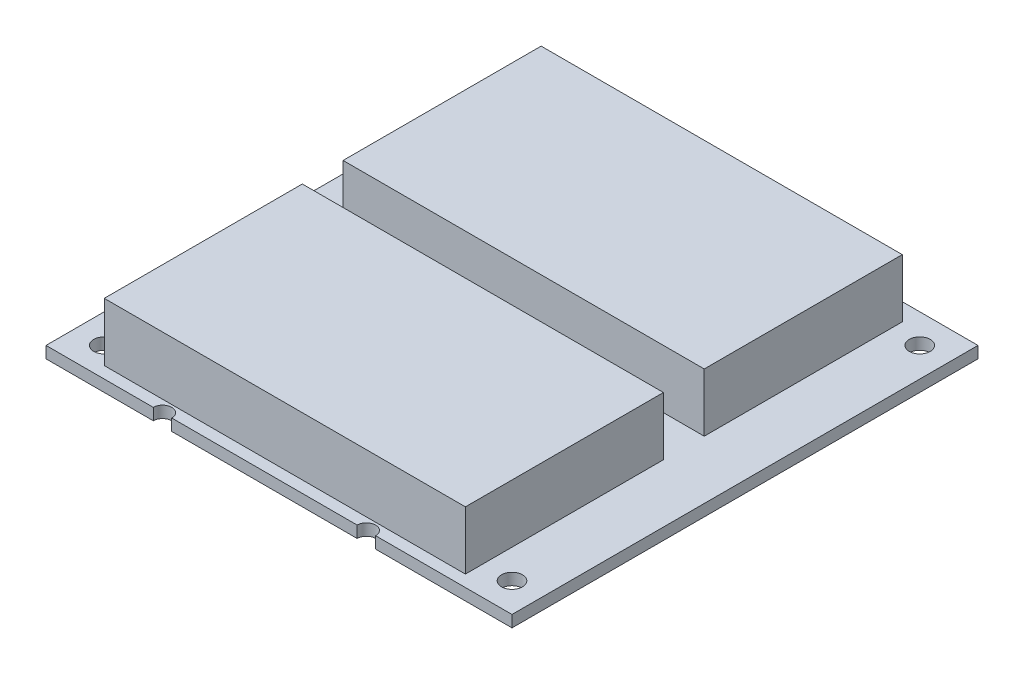
ISO-10303-21;
HEADER;
FILE_DESCRIPTION(('STEP AP214'),'2;1');
FILE_NAME('part.step','',(''),(''),'','','');
FILE_SCHEMA(('AUTOMOTIVE_DESIGN { 1 0 10303 214 1 1 1 1 }'));
ENDSEC;
DATA;
#1=APPLICATION_CONTEXT('core data for automotive mechanical design processes');
#2=APPLICATION_PROTOCOL_DEFINITION('international standard','automotive_design',2000,#1);
#3=PRODUCT_CONTEXT('',#1,'mechanical');
#4=PRODUCT('Part','Part','',(#3));
#5=PRODUCT_RELATED_PRODUCT_CATEGORY('part','',(#4));
#6=PRODUCT_DEFINITION_FORMATION('','',#4);
#7=PRODUCT_DEFINITION_CONTEXT('part definition',#1,'design');
#8=PRODUCT_DEFINITION('design','',#6,#7);
#9=PRODUCT_DEFINITION_SHAPE('','',#8);
#10=(LENGTH_UNIT() NAMED_UNIT(*) SI_UNIT(.MILLI.,.METRE.));
#11=(NAMED_UNIT(*) PLANE_ANGLE_UNIT() SI_UNIT($,.RADIAN.));
#12=(NAMED_UNIT(*) SI_UNIT($,.STERADIAN.) SOLID_ANGLE_UNIT());
#13=UNCERTAINTY_MEASURE_WITH_UNIT(LENGTH_MEASURE(1.E-05),#10,'distance_accuracy_value','');
#14=(GEOMETRIC_REPRESENTATION_CONTEXT(3) GLOBAL_UNCERTAINTY_ASSIGNED_CONTEXT((#13)) GLOBAL_UNIT_ASSIGNED_CONTEXT((#10,
#11,#12)) REPRESENTATION_CONTEXT('',''));
#15=CARTESIAN_POINT('',(0.,0.,0.));
#16=DIRECTION('',(0.,0.,1.));
#17=DIRECTION('',(1.,0.,0.));
#18=AXIS2_PLACEMENT_3D('',#15,#16,#17);
#19=CARTESIAN_POINT('',(0.,2.,-80.));
#20=DIRECTION('',(0.,0.,1.));
#21=DIRECTION('',(1.,0.,0.));
#22=AXIS2_PLACEMENT_3D('',#19,#20,#21);
#23=PLANE('',#22);
#24=DIRECTION('',(-1.,0.,0.));
#25=VECTOR('',#24,1.);
#26=CARTESIAN_POINT('',(0.,0.,-80.));
#27=LINE('',#26,#25);
#28=CARTESIAN_POINT('',(80.,0.,-80.));
#29=VERTEX_POINT('',#28);
#30=CARTESIAN_POINT('',(56.5875,0.,-80.));
#31=VERTEX_POINT('',#30);
#32=EDGE_CURVE('E187',#29,#31,#27,.T.);
#33=ORIENTED_EDGE('',*,*,#32,.T.);
#34=DIRECTION('',(0.,1.,0.));
#35=VECTOR('',#34,1.);
#36=CARTESIAN_POINT('',(56.5875,0.,-80.));
#37=LINE('',#36,#35);
#38=CARTESIAN_POINT('',(56.5875,2.,-80.));
#39=VERTEX_POINT('',#38);
#40=EDGE_CURVE('E47',#31,#39,#37,.T.);
#41=ORIENTED_EDGE('',*,*,#40,.T.);
#42=DIRECTION('',(-1.,0.,0.));
#43=VECTOR('',#42,1.);
#44=CARTESIAN_POINT('',(0.,2.,-80.));
#45=LINE('',#44,#43);
#46=CARTESIAN_POINT('',(80.,2.,-80.));
#47=VERTEX_POINT('',#46);
#48=EDGE_CURVE('E199',#47,#39,#45,.T.);
#49=ORIENTED_EDGE('',*,*,#48,.F.);
#50=DIRECTION('',(0.,-1.,0.));
#51=VECTOR('',#50,1.);
#52=CARTESIAN_POINT('',(80.,2.,-80.));
#53=LINE('',#52,#51);
#54=EDGE_CURVE('E198',#47,#29,#53,.T.);
#55=ORIENTED_EDGE('',*,*,#54,.T.);
#56=EDGE_LOOP('',(#33,#41,#49,#55));
#57=FACE_BOUND('',#56,.T.);
#58=ADVANCED_FACE('F33',(#57),#23,.F.);
#59=CARTESIAN_POINT('',(0.,2.,0.));
#60=DIRECTION('',(0.,0.,-1.));
#61=DIRECTION('',(-1.,0.,0.));
#62=AXIS2_PLACEMENT_3D('',#59,#60,#61);
#63=PLANE('',#62);
#64=DIRECTION('',(1.,0.,0.));
#65=VECTOR('',#64,1.);
#66=CARTESIAN_POINT('',(0.,0.,0.));
#67=LINE('',#66,#65);
#68=CARTESIAN_POINT('',(21.5875,0.,0.));
#69=VERTEX_POINT('',#68);
#70=CARTESIAN_POINT('',(53.4125,0.,0.));
#71=VERTEX_POINT('',#70);
#72=EDGE_CURVE('E232',#69,#71,#67,.T.);
#73=ORIENTED_EDGE('',*,*,#72,.T.);
#74=DIRECTION('',(0.,1.,0.));
#75=VECTOR('',#74,1.);
#76=CARTESIAN_POINT('',(53.4125,0.,0.));
#77=LINE('',#76,#75);
#78=CARTESIAN_POINT('',(53.4125,2.,0.));
#79=VERTEX_POINT('',#78);
#80=EDGE_CURVE('E55',#71,#79,#77,.T.);
#81=ORIENTED_EDGE('',*,*,#80,.T.);
#82=DIRECTION('',(1.,0.,0.));
#83=VECTOR('',#82,1.);
#84=CARTESIAN_POINT('',(0.,2.,0.));
#85=LINE('',#84,#83);
#86=CARTESIAN_POINT('',(21.5875,2.,0.));
#87=VERTEX_POINT('',#86);
#88=EDGE_CURVE('E370',#87,#79,#85,.T.);
#89=ORIENTED_EDGE('',*,*,#88,.F.);
#90=DIRECTION('',(0.,1.,0.));
#91=VECTOR('',#90,1.);
#92=CARTESIAN_POINT('',(21.5875,0.,0.));
#93=LINE('',#92,#91);
#94=EDGE_CURVE('E247',#87,#69,#93,.F.);
#95=ORIENTED_EDGE('',*,*,#94,.T.);
#96=EDGE_LOOP('',(#73,#81,#89,#95));
#97=FACE_BOUND('',#96,.T.);
#98=ADVANCED_FACE('F244',(#97),#63,.F.);
#99=CARTESIAN_POINT('',(53.4125,2.,-80.));
#100=VERTEX_POINT('',#99);
#101=CARTESIAN_POINT('',(21.5875,2.,-80.));
#102=VERTEX_POINT('',#101);
#103=EDGE_CURVE('E180',#100,#102,#45,.T.);
#104=ORIENTED_EDGE('',*,*,#103,.F.);
#105=DIRECTION('',(0.,1.,0.));
#106=VECTOR('',#105,1.);
#107=CARTESIAN_POINT('',(53.4125,0.,-80.));
#108=LINE('',#107,#106);
#109=CARTESIAN_POINT('',(53.4125,0.,-80.));
#110=VERTEX_POINT('',#109);
#111=EDGE_CURVE('E168',#100,#110,#108,.F.);
#112=ORIENTED_EDGE('',*,*,#111,.T.);
#113=CARTESIAN_POINT('',(21.5875,0.,-80.));
#114=VERTEX_POINT('',#113);
#115=EDGE_CURVE('E178',#110,#114,#27,.T.);
#116=ORIENTED_EDGE('',*,*,#115,.T.);
#117=DIRECTION('',(0.,1.,0.));
#118=VECTOR('',#117,1.);
#119=CARTESIAN_POINT('',(21.5875,0.,-80.));
#120=LINE('',#119,#118);
#121=EDGE_CURVE('E213',#114,#102,#120,.T.);
#122=ORIENTED_EDGE('',*,*,#121,.T.);
#123=EDGE_LOOP('',(#104,#112,#116,#122));
#124=FACE_BOUND('',#123,.T.);
#125=ADVANCED_FACE('F176',(#124),#23,.F.);
#126=CARTESIAN_POINT('',(0.,0.,0.));
#127=VERTEX_POINT('',#126);
#128=CARTESIAN_POINT('',(18.4125,0.,0.));
#129=VERTEX_POINT('',#128);
#130=EDGE_CURVE('E226',#127,#129,#67,.T.);
#131=ORIENTED_EDGE('',*,*,#130,.T.);
#132=DIRECTION('',(0.,1.,0.));
#133=VECTOR('',#132,1.);
#134=CARTESIAN_POINT('',(18.4125,0.,0.));
#135=LINE('',#134,#133);
#136=CARTESIAN_POINT('',(18.4125,2.,0.));
#137=VERTEX_POINT('',#136);
#138=EDGE_CURVE('E276',#129,#137,#135,.T.);
#139=ORIENTED_EDGE('',*,*,#138,.T.);
#140=CARTESIAN_POINT('',(0.,2.,0.));
#141=VERTEX_POINT('',#140);
#142=EDGE_CURVE('E367',#141,#137,#85,.T.);
#143=ORIENTED_EDGE('',*,*,#142,.F.);
#144=DIRECTION('',(0.,-1.,0.));
#145=VECTOR('',#144,1.);
#146=CARTESIAN_POINT('',(0.,2.,0.));
#147=LINE('',#146,#145);
#148=EDGE_CURVE('E205',#141,#127,#147,.T.);
#149=ORIENTED_EDGE('',*,*,#148,.T.);
#150=EDGE_LOOP('',(#131,#139,#143,#149));
#151=FACE_BOUND('',#150,.T.);
#152=ADVANCED_FACE('F395',(#151),#63,.F.);
#153=CARTESIAN_POINT('',(0.,2.,0.));
#154=DIRECTION('',(0.,-1.,0.));
#155=DIRECTION('',(0.,0.,-1.));
#156=AXIS2_PLACEMENT_3D('',#153,#154,#155);
#157=PLANE('',#156);
#158=CARTESIAN_POINT('',(55.,2.,-40.));
#159=DIRECTION('',(0.,1.,0.));
#160=DIRECTION('',(0.,0.,1.));
#161=AXIS2_PLACEMENT_3D('',#158,#159,#160);
#162=CIRCLE('',#161,1.5875);
#163=CARTESIAN_POINT('',(55.,2.,-38.4125));
#164=VERTEX_POINT('',#163);
#165=EDGE_CURVE('E260',#164,#164,#162,.T.);
#166=ORIENTED_EDGE('',*,*,#165,.F.);
#167=EDGE_LOOP('',(#166));
#168=FACE_BOUND('',#167,.T.);
#169=CARTESIAN_POINT('',(20.,2.,-40.));
#170=DIRECTION('',(0.,1.,0.));
#171=DIRECTION('',(0.,0.,1.));
#172=AXIS2_PLACEMENT_3D('',#169,#170,#171);
#173=CIRCLE('',#172,1.5875);
#174=CARTESIAN_POINT('',(20.,2.,-38.4125));
#175=VERTEX_POINT('',#174);
#176=EDGE_CURVE('E266',#175,#175,#173,.T.);
#177=ORIENTED_EDGE('',*,*,#176,.F.);
#178=EDGE_LOOP('',(#177));
#179=FACE_BOUND('',#178,.T.);
#180=CARTESIAN_POINT('',(5.,2.,-5.));
#181=DIRECTION('',(0.,1.,0.));
#182=DIRECTION('',(0.,0.,1.));
#183=AXIS2_PLACEMENT_3D('',#180,#181,#182);
#184=CIRCLE('',#183,1.8);
#185=CARTESIAN_POINT('',(5.,2.,-3.2));
#186=VERTEX_POINT('',#185);
#187=EDGE_CURVE('E278',#186,#186,#184,.T.);
#188=ORIENTED_EDGE('',*,*,#187,.F.);
#189=EDGE_LOOP('',(#188));
#190=FACE_BOUND('',#189,.T.);
#191=CARTESIAN_POINT('',(75.,2.,-5.));
#192=DIRECTION('',(0.,1.,0.));
#193=DIRECTION('',(0.,0.,1.));
#194=AXIS2_PLACEMENT_3D('',#191,#192,#193);
#195=CIRCLE('',#194,1.79999999999999);
#196=CARTESIAN_POINT('',(75.,2.,-3.20000000000001));
#197=VERTEX_POINT('',#196);
#198=EDGE_CURVE('E282',#197,#197,#195,.T.);
#199=ORIENTED_EDGE('',*,*,#198,.F.);
#200=EDGE_LOOP('',(#199));
#201=FACE_BOUND('',#200,.T.);
#202=CARTESIAN_POINT('',(75.,2.,-75.));
#203=DIRECTION('',(0.,1.,0.));
#204=DIRECTION('',(0.,0.,1.));
#205=AXIS2_PLACEMENT_3D('',#202,#203,#204);
#206=CIRCLE('',#205,1.79999999999999);
#207=CARTESIAN_POINT('',(75.,2.,-73.2));
#208=VERTEX_POINT('',#207);
#209=EDGE_CURVE('E288',#208,#208,#206,.T.);
#210=ORIENTED_EDGE('',*,*,#209,.F.);
#211=EDGE_LOOP('',(#210));
#212=FACE_BOUND('',#211,.T.);
#213=CARTESIAN_POINT('',(5.,2.,-75.));
#214=DIRECTION('',(0.,1.,0.));
#215=DIRECTION('',(0.,0.,1.));
#216=AXIS2_PLACEMENT_3D('',#213,#214,#215);
#217=CIRCLE('',#216,1.8);
#218=CARTESIAN_POINT('',(5.,2.,-73.2));
#219=VERTEX_POINT('',#218);
#220=EDGE_CURVE('E294',#219,#219,#217,.T.);
#221=ORIENTED_EDGE('',*,*,#220,.F.);
#222=EDGE_LOOP('',(#221));
#223=FACE_BOUND('',#222,.T.);
#224=DIRECTION('',(0.,0.,1.));
#225=VECTOR('',#224,1.);
#226=CARTESIAN_POINT('',(8.,2.,-36.));
#227=LINE('',#226,#225);
#228=CARTESIAN_POINT('',(8.,2.,-36.));
#229=VERTEX_POINT('',#228);
#230=CARTESIAN_POINT('',(8.00000000000001,2.,-2.));
#231=VERTEX_POINT('',#230);
#232=EDGE_CURVE('E335',#229,#231,#227,.T.);
#233=ORIENTED_EDGE('',*,*,#232,.F.);
#234=DIRECTION('',(-1.,0.,0.));
#235=VECTOR('',#234,1.);
#236=CARTESIAN_POINT('',(8.,2.,-36.));
#237=LINE('',#236,#235);
#238=CARTESIAN_POINT('',(70.,2.,-36.));
#239=VERTEX_POINT('',#238);
#240=EDGE_CURVE('E340',#239,#229,#237,.T.);
#241=ORIENTED_EDGE('',*,*,#240,.F.);
#242=DIRECTION('',(0.,0.,-1.));
#243=VECTOR('',#242,1.);
#244=CARTESIAN_POINT('',(70.,2.,-36.));
#245=LINE('',#244,#243);
#246=CARTESIAN_POINT('',(70.,2.,-2.));
#247=VERTEX_POINT('',#246);
#248=EDGE_CURVE('E352',#247,#239,#245,.T.);
#249=ORIENTED_EDGE('',*,*,#248,.F.);
#250=DIRECTION('',(1.,0.,0.));
#251=VECTOR('',#250,1.);
#252=CARTESIAN_POINT('',(8.00000000000001,2.,-2.));
#253=LINE('',#252,#251);
#254=EDGE_CURVE('E349',#231,#247,#253,.T.);
#255=ORIENTED_EDGE('',*,*,#254,.F.);
#256=EDGE_LOOP('',(#233,#241,#249,#255));
#257=FACE_BOUND('',#256,.T.);
#258=ORIENTED_EDGE('',*,*,#48,.T.);
#259=CARTESIAN_POINT('',(55.,2.,-80.));
#260=DIRECTION('',(0.,1.,0.));
#261=DIRECTION('',(0.,0.,1.));
#262=AXIS2_PLACEMENT_3D('',#259,#260,#261);
#263=CIRCLE('',#262,1.5875);
#264=EDGE_CURVE('E181',#100,#39,#263,.T.);
#265=ORIENTED_EDGE('',*,*,#264,.F.);
#266=ORIENTED_EDGE('',*,*,#103,.T.);
#267=CARTESIAN_POINT('',(20.,2.,-80.));
#268=DIRECTION('',(0.,1.,0.));
#269=DIRECTION('',(0.,0.,1.));
#270=AXIS2_PLACEMENT_3D('',#267,#268,#269);
#271=CIRCLE('',#270,1.5875);
#272=CARTESIAN_POINT('',(18.4125,2.,-80.));
#273=VERTEX_POINT('',#272);
#274=EDGE_CURVE('E219',#273,#102,#271,.T.);
#275=ORIENTED_EDGE('',*,*,#274,.F.);
#276=CARTESIAN_POINT('',(0.,2.,-80.));
#277=VERTEX_POINT('',#276);
#278=EDGE_CURVE('E218',#273,#277,#45,.T.);
#279=ORIENTED_EDGE('',*,*,#278,.T.);
#280=DIRECTION('',(0.,0.,1.));
#281=VECTOR('',#280,1.);
#282=CARTESIAN_POINT('',(0.,2.,0.));
#283=LINE('',#282,#281);
#284=EDGE_CURVE('E190',#277,#141,#283,.T.);
#285=ORIENTED_EDGE('',*,*,#284,.T.);
#286=ORIENTED_EDGE('',*,*,#142,.T.);
#287=CARTESIAN_POINT('',(20.,2.,0.));
#288=DIRECTION('',(0.,1.,0.));
#289=DIRECTION('',(0.,0.,1.));
#290=AXIS2_PLACEMENT_3D('',#287,#288,#289);
#291=CIRCLE('',#290,1.5875);
#292=EDGE_CURVE('E270',#87,#137,#291,.T.);
#293=ORIENTED_EDGE('',*,*,#292,.F.);
#294=ORIENTED_EDGE('',*,*,#88,.T.);
#295=CARTESIAN_POINT('',(55.,2.,0.));
#296=DIRECTION('',(0.,1.,0.));
#297=DIRECTION('',(0.,0.,1.));
#298=AXIS2_PLACEMENT_3D('',#295,#296,#297);
#299=CIRCLE('',#298,1.5875);
#300=CARTESIAN_POINT('',(56.5875,2.,0.));
#301=VERTEX_POINT('',#300);
#302=EDGE_CURVE('E254',#301,#79,#299,.T.);
#303=ORIENTED_EDGE('',*,*,#302,.F.);
#304=CARTESIAN_POINT('',(80.,2.,0.));
#305=VERTEX_POINT('',#304);
#306=EDGE_CURVE('E366',#301,#305,#85,.T.);
#307=ORIENTED_EDGE('',*,*,#306,.T.);
#308=DIRECTION('',(0.,0.,-1.));
#309=VECTOR('',#308,1.);
#310=CARTESIAN_POINT('',(80.,2.,0.));
#311=LINE('',#310,#309);
#312=EDGE_CURVE('E369',#305,#47,#311,.T.);
#313=ORIENTED_EDGE('',*,*,#312,.T.);
#314=EDGE_LOOP('',(#258,#265,#266,#275,#279,#285,#286,#293,#294,#303,#307,#313));
#315=FACE_BOUND('',#314,.T.);
#316=DIRECTION('',(0.,0.,1.));
#317=VECTOR('',#316,1.);
#318=CARTESIAN_POINT('',(8.,2.,-77.));
#319=LINE('',#318,#317);
#320=CARTESIAN_POINT('',(8.,2.,-77.));
#321=VERTEX_POINT('',#320);
#322=CARTESIAN_POINT('',(8.00000000000001,2.,-43.));
#323=VERTEX_POINT('',#322);
#324=EDGE_CURVE('E300',#321,#323,#319,.T.);
#325=ORIENTED_EDGE('',*,*,#324,.F.);
#326=DIRECTION('',(-1.,0.,0.));
#327=VECTOR('',#326,1.);
#328=CARTESIAN_POINT('',(8.,2.,-77.));
#329=LINE('',#328,#327);
#330=CARTESIAN_POINT('',(70.,2.,-77.));
#331=VERTEX_POINT('',#330);
#332=EDGE_CURVE('E307',#331,#321,#329,.T.);
#333=ORIENTED_EDGE('',*,*,#332,.F.);
#334=DIRECTION('',(0.,0.,-1.));
#335=VECTOR('',#334,1.);
#336=CARTESIAN_POINT('',(70.,2.,-77.));
#337=LINE('',#336,#335);
#338=CARTESIAN_POINT('',(70.,2.,-43.));
#339=VERTEX_POINT('',#338);
#340=EDGE_CURVE('E319',#339,#331,#337,.T.);
#341=ORIENTED_EDGE('',*,*,#340,.F.);
#342=DIRECTION('',(1.,0.,0.));
#343=VECTOR('',#342,1.);
#344=CARTESIAN_POINT('',(8.00000000000001,2.,-43.));
#345=LINE('',#344,#343);
#346=EDGE_CURVE('E316',#323,#339,#345,.T.);
#347=ORIENTED_EDGE('',*,*,#346,.F.);
#348=EDGE_LOOP('',(#325,#333,#341,#347));
#349=FACE_BOUND('',#348,.T.);
#350=ADVANCED_FACE('F376',(#168,#179,#190,#201,#212,#223,#257,#315,#349),#157,.F.);
#351=CARTESIAN_POINT('',(0.,2.,0.));
#352=DIRECTION('',(1.,0.,0.));
#353=DIRECTION('',(0.,0.,-1.));
#354=AXIS2_PLACEMENT_3D('',#351,#352,#353);
#355=PLANE('',#354);
#356=DIRECTION('',(0.,0.,1.));
#357=VECTOR('',#356,1.);
#358=CARTESIAN_POINT('',(0.,0.,0.));
#359=LINE('',#358,#357);
#360=CARTESIAN_POINT('',(0.,0.,-80.));
#361=VERTEX_POINT('',#360);
#362=EDGE_CURVE('E223',#361,#127,#359,.T.);
#363=ORIENTED_EDGE('',*,*,#362,.T.);
#364=ORIENTED_EDGE('',*,*,#148,.F.);
#365=ORIENTED_EDGE('',*,*,#284,.F.);
#366=DIRECTION('',(0.,-1.,0.));
#367=VECTOR('',#366,1.);
#368=CARTESIAN_POINT('',(0.,2.,-80.));
#369=LINE('',#368,#367);
#370=EDGE_CURVE('E195',#277,#361,#369,.T.);
#371=ORIENTED_EDGE('',*,*,#370,.T.);
#372=EDGE_LOOP('',(#363,#364,#365,#371));
#373=FACE_BOUND('',#372,.T.);
#374=ADVANCED_FACE('F35',(#373),#355,.F.);
#375=ORIENTED_EDGE('',*,*,#306,.F.);
#376=DIRECTION('',(0.,1.,0.));
#377=VECTOR('',#376,1.);
#378=CARTESIAN_POINT('',(56.5875,0.,0.));
#379=LINE('',#378,#377);
#380=CARTESIAN_POINT('',(56.5875,0.,0.));
#381=VERTEX_POINT('',#380);
#382=EDGE_CURVE('E253',#301,#381,#379,.F.);
#383=ORIENTED_EDGE('',*,*,#382,.T.);
#384=CARTESIAN_POINT('',(80.,0.,0.));
#385=VERTEX_POINT('',#384);
#386=EDGE_CURVE('E229',#381,#385,#67,.T.);
#387=ORIENTED_EDGE('',*,*,#386,.T.);
#388=DIRECTION('',(0.,-1.,0.));
#389=VECTOR('',#388,1.);
#390=CARTESIAN_POINT('',(80.,2.,0.));
#391=LINE('',#390,#389);
#392=EDGE_CURVE('E202',#305,#385,#391,.T.);
#393=ORIENTED_EDGE('',*,*,#392,.F.);
#394=EDGE_LOOP('',(#375,#383,#387,#393));
#395=FACE_BOUND('',#394,.T.);
#396=ADVANCED_FACE('F437',(#395),#63,.F.);
#397=CARTESIAN_POINT('',(80.,2.,0.));
#398=DIRECTION('',(-1.,0.,0.));
#399=DIRECTION('',(0.,0.,1.));
#400=AXIS2_PLACEMENT_3D('',#397,#398,#399);
#401=PLANE('',#400);
#402=DIRECTION('',(0.,0.,-1.));
#403=VECTOR('',#402,1.);
#404=CARTESIAN_POINT('',(80.,0.,0.));
#405=LINE('',#404,#403);
#406=EDGE_CURVE('E191',#385,#29,#405,.T.);
#407=ORIENTED_EDGE('',*,*,#406,.T.);
#408=ORIENTED_EDGE('',*,*,#54,.F.);
#409=ORIENTED_EDGE('',*,*,#312,.F.);
#410=ORIENTED_EDGE('',*,*,#392,.T.);
#411=EDGE_LOOP('',(#407,#408,#409,#410));
#412=FACE_BOUND('',#411,.T.);
#413=ADVANCED_FACE('F442',(#412),#401,.F.);
#414=ORIENTED_EDGE('',*,*,#278,.F.);
#415=DIRECTION('',(0.,1.,0.));
#416=VECTOR('',#415,1.);
#417=CARTESIAN_POINT('',(18.4125,0.,-80.));
#418=LINE('',#417,#416);
#419=CARTESIAN_POINT('',(18.4125,0.,-80.));
#420=VERTEX_POINT('',#419);
#421=EDGE_CURVE('E211',#273,#420,#418,.F.);
#422=ORIENTED_EDGE('',*,*,#421,.T.);
#423=EDGE_CURVE('E188',#420,#361,#27,.T.);
#424=ORIENTED_EDGE('',*,*,#423,.T.);
#425=ORIENTED_EDGE('',*,*,#370,.F.);
#426=EDGE_LOOP('',(#414,#422,#424,#425));
#427=FACE_BOUND('',#426,.T.);
#428=ADVANCED_FACE('F216',(#427),#23,.F.);
#429=CARTESIAN_POINT('',(0.,0.,0.));
#430=DIRECTION('',(0.,-1.,0.));
#431=DIRECTION('',(0.,0.,-1.));
#432=AXIS2_PLACEMENT_3D('',#429,#430,#431);
#433=PLANE('',#432);
#434=CARTESIAN_POINT('',(55.,0.,-80.));
#435=DIRECTION('',(0.,-1.,0.));
#436=DIRECTION('',(0.,0.,-1.));
#437=AXIS2_PLACEMENT_3D('',#434,#435,#436);
#438=CIRCLE('',#437,1.5875);
#439=EDGE_CURVE('E11',#31,#110,#438,.T.);
#440=ORIENTED_EDGE('',*,*,#439,.F.);
#441=ORIENTED_EDGE('',*,*,#32,.F.);
#442=ORIENTED_EDGE('',*,*,#406,.F.);
#443=ORIENTED_EDGE('',*,*,#386,.F.);
#444=CARTESIAN_POINT('',(55.,0.,0.));
#445=DIRECTION('',(0.,1.,0.));
#446=DIRECTION('',(0.,0.,1.));
#447=AXIS2_PLACEMENT_3D('',#444,#445,#446);
#448=CIRCLE('',#447,1.5875);
#449=EDGE_CURVE('E250',#381,#71,#448,.T.);
#450=ORIENTED_EDGE('',*,*,#449,.T.);
#451=ORIENTED_EDGE('',*,*,#72,.F.);
#452=CARTESIAN_POINT('',(20.,0.,0.));
#453=DIRECTION('',(0.,1.,0.));
#454=DIRECTION('',(0.,0.,1.));
#455=AXIS2_PLACEMENT_3D('',#452,#453,#454);
#456=CIRCLE('',#455,1.5875);
#457=EDGE_CURVE('E248',#69,#129,#456,.T.);
#458=ORIENTED_EDGE('',*,*,#457,.T.);
#459=ORIENTED_EDGE('',*,*,#130,.F.);
#460=ORIENTED_EDGE('',*,*,#362,.F.);
#461=ORIENTED_EDGE('',*,*,#423,.F.);
#462=CARTESIAN_POINT('',(20.,0.,-80.));
#463=DIRECTION('',(0.,-1.,0.));
#464=DIRECTION('',(0.,0.,-1.));
#465=AXIS2_PLACEMENT_3D('',#462,#463,#464);
#466=CIRCLE('',#465,1.5875);
#467=EDGE_CURVE('E41',#114,#420,#466,.T.);
#468=ORIENTED_EDGE('',*,*,#467,.F.);
#469=ORIENTED_EDGE('',*,*,#115,.F.);
#470=EDGE_LOOP('',(#440,#441,#442,#443,#450,#451,#458,#459,#460,#461,#468,#469));
#471=FACE_BOUND('',#470,.T.);
#472=CARTESIAN_POINT('',(55.,0.,-40.));
#473=DIRECTION('',(0.,1.,0.));
#474=DIRECTION('',(0.,0.,1.));
#475=AXIS2_PLACEMENT_3D('',#472,#473,#474);
#476=CIRCLE('',#475,1.5875);
#477=CARTESIAN_POINT('',(55.,0.,-38.4125));
#478=VERTEX_POINT('',#477);
#479=EDGE_CURVE('E257',#478,#478,#476,.T.);
#480=ORIENTED_EDGE('',*,*,#479,.T.);
#481=EDGE_LOOP('',(#480));
#482=FACE_BOUND('',#481,.T.);
#483=CARTESIAN_POINT('',(20.,0.,-40.));
#484=DIRECTION('',(0.,1.,0.));
#485=DIRECTION('',(0.,0.,1.));
#486=AXIS2_PLACEMENT_3D('',#483,#484,#485);
#487=CIRCLE('',#486,1.5875);
#488=CARTESIAN_POINT('',(20.,0.,-38.4125));
#489=VERTEX_POINT('',#488);
#490=EDGE_CURVE('E267',#489,#489,#487,.T.);
#491=ORIENTED_EDGE('',*,*,#490,.T.);
#492=EDGE_LOOP('',(#491));
#493=FACE_BOUND('',#492,.T.);
#494=CARTESIAN_POINT('',(5.,0.,-5.));
#495=DIRECTION('',(0.,1.,0.));
#496=DIRECTION('',(0.,0.,1.));
#497=AXIS2_PLACEMENT_3D('',#494,#495,#496);
#498=CIRCLE('',#497,1.8);
#499=CARTESIAN_POINT('',(5.,0.,-3.2));
#500=VERTEX_POINT('',#499);
#501=EDGE_CURVE('E279',#500,#500,#498,.T.);
#502=ORIENTED_EDGE('',*,*,#501,.T.);
#503=EDGE_LOOP('',(#502));
#504=FACE_BOUND('',#503,.T.);
#505=CARTESIAN_POINT('',(75.,0.,-5.));
#506=DIRECTION('',(0.,1.,0.));
#507=DIRECTION('',(0.,0.,1.));
#508=AXIS2_PLACEMENT_3D('',#505,#506,#507);
#509=CIRCLE('',#508,1.79999999999999);
#510=CARTESIAN_POINT('',(75.,0.,-3.20000000000001));
#511=VERTEX_POINT('',#510);
#512=EDGE_CURVE('E285',#511,#511,#509,.T.);
#513=ORIENTED_EDGE('',*,*,#512,.T.);
#514=EDGE_LOOP('',(#513));
#515=FACE_BOUND('',#514,.T.);
#516=CARTESIAN_POINT('',(75.,0.,-75.));
#517=DIRECTION('',(0.,1.,0.));
#518=DIRECTION('',(0.,0.,1.));
#519=AXIS2_PLACEMENT_3D('',#516,#517,#518);
#520=CIRCLE('',#519,1.79999999999999);
#521=CARTESIAN_POINT('',(75.,0.,-73.2));
#522=VERTEX_POINT('',#521);
#523=EDGE_CURVE('E291',#522,#522,#520,.T.);
#524=ORIENTED_EDGE('',*,*,#523,.T.);
#525=EDGE_LOOP('',(#524));
#526=FACE_BOUND('',#525,.T.);
#527=CARTESIAN_POINT('',(5.,0.,-75.));
#528=DIRECTION('',(0.,1.,0.));
#529=DIRECTION('',(0.,0.,1.));
#530=AXIS2_PLACEMENT_3D('',#527,#528,#529);
#531=CIRCLE('',#530,1.8);
#532=CARTESIAN_POINT('',(5.,0.,-73.2));
#533=VERTEX_POINT('',#532);
#534=EDGE_CURVE('E297',#533,#533,#531,.T.);
#535=ORIENTED_EDGE('',*,*,#534,.T.);
#536=EDGE_LOOP('',(#535));
#537=FACE_BOUND('',#536,.T.);
#538=ADVANCED_FACE('F184',(#471,#482,#493,#504,#515,#526,#537),#433,.T.);
#539=CARTESIAN_POINT('',(8.,12.,-36.));
#540=DIRECTION('',(1.,0.,0.));
#541=DIRECTION('',(0.,0.,-1.));
#542=AXIS2_PLACEMENT_3D('',#539,#540,#541);
#543=PLANE('',#542);
#544=ORIENTED_EDGE('',*,*,#232,.T.);
#545=DIRECTION('',(0.,-1.,0.));
#546=VECTOR('',#545,1.);
#547=CARTESIAN_POINT('',(8.00000000000001,12.,-2.));
#548=LINE('',#547,#546);
#549=CARTESIAN_POINT('',(8.00000000000001,12.,-2.));
#550=VERTEX_POINT('',#549);
#551=EDGE_CURVE('E230',#550,#231,#548,.T.);
#552=ORIENTED_EDGE('',*,*,#551,.F.);
#553=DIRECTION('',(0.,0.,1.));
#554=VECTOR('',#553,1.);
#555=CARTESIAN_POINT('',(8.,12.,-36.));
#556=LINE('',#555,#554);
#557=CARTESIAN_POINT('',(8.,12.,-36.));
#558=VERTEX_POINT('',#557);
#559=EDGE_CURVE('E336',#558,#550,#556,.T.);
#560=ORIENTED_EDGE('',*,*,#559,.F.);
#561=DIRECTION('',(0.,-1.,0.));
#562=VECTOR('',#561,1.);
#563=CARTESIAN_POINT('',(8.,12.,-36.));
#564=LINE('',#563,#562);
#565=EDGE_CURVE('E346',#558,#229,#564,.T.);
#566=ORIENTED_EDGE('',*,*,#565,.T.);
#567=EDGE_LOOP('',(#544,#552,#560,#566));
#568=FACE_BOUND('',#567,.T.);
#569=ADVANCED_FACE('F415',(#568),#543,.F.);
#570=CARTESIAN_POINT('',(8.00000000000001,12.,-2.));
#571=DIRECTION('',(0.,0.,-1.));
#572=DIRECTION('',(-1.,0.,0.));
#573=AXIS2_PLACEMENT_3D('',#570,#571,#572);
#574=PLANE('',#573);
#575=ORIENTED_EDGE('',*,*,#254,.T.);
#576=DIRECTION('',(0.,-1.,0.));
#577=VECTOR('',#576,1.);
#578=CARTESIAN_POINT('',(70.,12.,-2.));
#579=LINE('',#578,#577);
#580=CARTESIAN_POINT('',(70.,12.,-2.));
#581=VERTEX_POINT('',#580);
#582=EDGE_CURVE('E234',#581,#247,#579,.T.);
#583=ORIENTED_EDGE('',*,*,#582,.F.);
#584=DIRECTION('',(1.,0.,0.));
#585=VECTOR('',#584,1.);
#586=CARTESIAN_POINT('',(8.00000000000001,12.,-2.));
#587=LINE('',#586,#585);
#588=EDGE_CURVE('E339',#550,#581,#587,.T.);
#589=ORIENTED_EDGE('',*,*,#588,.F.);
#590=ORIENTED_EDGE('',*,*,#551,.T.);
#591=EDGE_LOOP('',(#575,#583,#589,#590));
#592=FACE_BOUND('',#591,.T.);
#593=ADVANCED_FACE('F423',(#592),#574,.F.);
#594=CARTESIAN_POINT('',(70.,12.,-36.));
#595=DIRECTION('',(-1.,0.,0.));
#596=DIRECTION('',(0.,0.,1.));
#597=AXIS2_PLACEMENT_3D('',#594,#595,#596);
#598=PLANE('',#597);
#599=ORIENTED_EDGE('',*,*,#248,.T.);
#600=DIRECTION('',(0.,-1.,0.));
#601=VECTOR('',#600,1.);
#602=CARTESIAN_POINT('',(70.,12.,-36.));
#603=LINE('',#602,#601);
#604=CARTESIAN_POINT('',(70.,12.,-36.));
#605=VERTEX_POINT('',#604);
#606=EDGE_CURVE('E359',#605,#239,#603,.T.);
#607=ORIENTED_EDGE('',*,*,#606,.F.);
#608=DIRECTION('',(0.,0.,-1.));
#609=VECTOR('',#608,1.);
#610=CARTESIAN_POINT('',(70.,12.,-36.));
#611=LINE('',#610,#609);
#612=EDGE_CURVE('E342',#581,#605,#611,.T.);
#613=ORIENTED_EDGE('',*,*,#612,.F.);
#614=ORIENTED_EDGE('',*,*,#582,.T.);
#615=EDGE_LOOP('',(#599,#607,#613,#614));
#616=FACE_BOUND('',#615,.T.);
#617=ADVANCED_FACE('F421',(#616),#598,.F.);
#618=CARTESIAN_POINT('',(8.,12.,-36.));
#619=DIRECTION('',(0.,0.,1.));
#620=DIRECTION('',(1.,0.,0.));
#621=AXIS2_PLACEMENT_3D('',#618,#619,#620);
#622=PLANE('',#621);
#623=ORIENTED_EDGE('',*,*,#240,.T.);
#624=ORIENTED_EDGE('',*,*,#565,.F.);
#625=DIRECTION('',(-1.,0.,0.));
#626=VECTOR('',#625,1.);
#627=CARTESIAN_POINT('',(8.,12.,-36.));
#628=LINE('',#627,#626);
#629=EDGE_CURVE('E344',#605,#558,#628,.T.);
#630=ORIENTED_EDGE('',*,*,#629,.F.);
#631=ORIENTED_EDGE('',*,*,#606,.T.);
#632=EDGE_LOOP('',(#623,#624,#630,#631));
#633=FACE_BOUND('',#632,.T.);
#634=ADVANCED_FACE('F411',(#633),#622,.F.);
#635=CARTESIAN_POINT('',(0.,12.,0.));
#636=DIRECTION('',(0.,1.,0.));
#637=DIRECTION('',(0.,0.,1.));
#638=AXIS2_PLACEMENT_3D('',#635,#636,#637);
#639=PLANE('',#638);
#640=ORIENTED_EDGE('',*,*,#559,.T.);
#641=ORIENTED_EDGE('',*,*,#588,.T.);
#642=ORIENTED_EDGE('',*,*,#612,.T.);
#643=ORIENTED_EDGE('',*,*,#629,.T.);
#644=EDGE_LOOP('',(#640,#641,#642,#643));
#645=FACE_BOUND('',#644,.T.);
#646=ADVANCED_FACE('F417',(#645),#639,.T.);
#647=CARTESIAN_POINT('',(8.,12.,-77.));
#648=DIRECTION('',(1.,0.,0.));
#649=DIRECTION('',(0.,0.,-1.));
#650=AXIS2_PLACEMENT_3D('',#647,#648,#649);
#651=PLANE('',#650);
#652=ORIENTED_EDGE('',*,*,#324,.T.);
#653=DIRECTION('',(0.,-1.,0.));
#654=VECTOR('',#653,1.);
#655=CARTESIAN_POINT('',(8.00000000000001,12.,-43.));
#656=LINE('',#655,#654);
#657=CARTESIAN_POINT('',(8.00000000000001,12.,-43.));
#658=VERTEX_POINT('',#657);
#659=EDGE_CURVE('E332',#658,#323,#656,.T.);
#660=ORIENTED_EDGE('',*,*,#659,.F.);
#661=DIRECTION('',(0.,0.,1.));
#662=VECTOR('',#661,1.);
#663=CARTESIAN_POINT('',(8.,12.,-77.));
#664=LINE('',#663,#662);
#665=CARTESIAN_POINT('',(8.,12.,-77.));
#666=VERTEX_POINT('',#665);
#667=EDGE_CURVE('E303',#666,#658,#664,.T.);
#668=ORIENTED_EDGE('',*,*,#667,.F.);
#669=DIRECTION('',(0.,-1.,0.));
#670=VECTOR('',#669,1.);
#671=CARTESIAN_POINT('',(8.,12.,-77.));
#672=LINE('',#671,#670);
#673=EDGE_CURVE('E313',#666,#321,#672,.T.);
#674=ORIENTED_EDGE('',*,*,#673,.T.);
#675=EDGE_LOOP('',(#652,#660,#668,#674));
#676=FACE_BOUND('',#675,.T.);
#677=ADVANCED_FACE('F563',(#676),#651,.F.);
#678=CARTESIAN_POINT('',(8.00000000000001,12.,-43.));
#679=DIRECTION('',(0.,0.,-1.));
#680=DIRECTION('',(-1.,0.,0.));
#681=AXIS2_PLACEMENT_3D('',#678,#679,#680);
#682=PLANE('',#681);
#683=ORIENTED_EDGE('',*,*,#346,.T.);
#684=DIRECTION('',(0.,-1.,0.));
#685=VECTOR('',#684,1.);
#686=CARTESIAN_POINT('',(70.,12.,-43.));
#687=LINE('',#686,#685);
#688=CARTESIAN_POINT('',(70.,12.,-43.));
#689=VERTEX_POINT('',#688);
#690=EDGE_CURVE('E329',#689,#339,#687,.T.);
#691=ORIENTED_EDGE('',*,*,#690,.F.);
#692=DIRECTION('',(1.,0.,0.));
#693=VECTOR('',#692,1.);
#694=CARTESIAN_POINT('',(8.00000000000001,12.,-43.));
#695=LINE('',#694,#693);
#696=EDGE_CURVE('E306',#658,#689,#695,.T.);
#697=ORIENTED_EDGE('',*,*,#696,.F.);
#698=ORIENTED_EDGE('',*,*,#659,.T.);
#699=EDGE_LOOP('',(#683,#691,#697,#698));
#700=FACE_BOUND('',#699,.T.);
#701=ADVANCED_FACE('F559',(#700),#682,.F.);
#702=CARTESIAN_POINT('',(70.,12.,-77.));
#703=DIRECTION('',(-1.,0.,0.));
#704=DIRECTION('',(0.,0.,1.));
#705=AXIS2_PLACEMENT_3D('',#702,#703,#704);
#706=PLANE('',#705);
#707=ORIENTED_EDGE('',*,*,#340,.T.);
#708=DIRECTION('',(0.,-1.,0.));
#709=VECTOR('',#708,1.);
#710=CARTESIAN_POINT('',(70.,12.,-77.));
#711=LINE('',#710,#709);
#712=CARTESIAN_POINT('',(70.,12.,-77.));
#713=VERTEX_POINT('',#712);
#714=EDGE_CURVE('E326',#713,#331,#711,.T.);
#715=ORIENTED_EDGE('',*,*,#714,.F.);
#716=DIRECTION('',(0.,0.,-1.));
#717=VECTOR('',#716,1.);
#718=CARTESIAN_POINT('',(70.,12.,-77.));
#719=LINE('',#718,#717);
#720=EDGE_CURVE('E309',#689,#713,#719,.T.);
#721=ORIENTED_EDGE('',*,*,#720,.F.);
#722=ORIENTED_EDGE('',*,*,#690,.T.);
#723=EDGE_LOOP('',(#707,#715,#721,#722));
#724=FACE_BOUND('',#723,.T.);
#725=ADVANCED_FACE('F555',(#724),#706,.F.);
#726=CARTESIAN_POINT('',(8.,12.,-77.));
#727=DIRECTION('',(0.,0.,1.));
#728=DIRECTION('',(1.,0.,0.));
#729=AXIS2_PLACEMENT_3D('',#726,#727,#728);
#730=PLANE('',#729);
#731=ORIENTED_EDGE('',*,*,#332,.T.);
#732=ORIENTED_EDGE('',*,*,#673,.F.);
#733=DIRECTION('',(-1.,0.,0.));
#734=VECTOR('',#733,1.);
#735=CARTESIAN_POINT('',(8.,12.,-77.));
#736=LINE('',#735,#734);
#737=EDGE_CURVE('E311',#713,#666,#736,.T.);
#738=ORIENTED_EDGE('',*,*,#737,.F.);
#739=ORIENTED_EDGE('',*,*,#714,.T.);
#740=EDGE_LOOP('',(#731,#732,#738,#739));
#741=FACE_BOUND('',#740,.T.);
#742=ADVANCED_FACE('F551',(#741),#730,.F.);
#743=CARTESIAN_POINT('',(0.,12.,-41.));
#744=DIRECTION('',(0.,1.,0.));
#745=DIRECTION('',(0.,0.,1.));
#746=AXIS2_PLACEMENT_3D('',#743,#744,#745);
#747=PLANE('',#746);
#748=ORIENTED_EDGE('',*,*,#667,.T.);
#749=ORIENTED_EDGE('',*,*,#696,.T.);
#750=ORIENTED_EDGE('',*,*,#720,.T.);
#751=ORIENTED_EDGE('',*,*,#737,.T.);
#752=EDGE_LOOP('',(#748,#749,#750,#751));
#753=FACE_BOUND('',#752,.T.);
#754=ADVANCED_FACE('F547',(#753),#747,.T.);
#755=CARTESIAN_POINT('',(5.,0.,-75.));
#756=DIRECTION('',(0.,1.,0.));
#757=DIRECTION('',(0.,0.,1.));
#758=AXIS2_PLACEMENT_3D('',#755,#756,#757);
#759=CYLINDRICAL_SURFACE('',#758,1.8);
#760=ORIENTED_EDGE('',*,*,#534,.F.);
#761=EDGE_LOOP('',(#760));
#762=FACE_BOUND('',#761,.T.);
#763=ORIENTED_EDGE('',*,*,#220,.T.);
#764=EDGE_LOOP('',(#763));
#765=FACE_BOUND('',#764,.T.);
#766=ADVANCED_FACE('F543',(#762,#765),#759,.F.);
#767=CARTESIAN_POINT('',(75.,0.,-75.));
#768=DIRECTION('',(0.,1.,0.));
#769=DIRECTION('',(0.,0.,1.));
#770=AXIS2_PLACEMENT_3D('',#767,#768,#769);
#771=CYLINDRICAL_SURFACE('',#770,1.79999999999999);
#772=ORIENTED_EDGE('',*,*,#523,.F.);
#773=EDGE_LOOP('',(#772));
#774=FACE_BOUND('',#773,.T.);
#775=ORIENTED_EDGE('',*,*,#209,.T.);
#776=EDGE_LOOP('',(#775));
#777=FACE_BOUND('',#776,.T.);
#778=ADVANCED_FACE('F539',(#774,#777),#771,.F.);
#779=CARTESIAN_POINT('',(75.,0.,-5.));
#780=DIRECTION('',(0.,1.,0.));
#781=DIRECTION('',(0.,0.,1.));
#782=AXIS2_PLACEMENT_3D('',#779,#780,#781);
#783=CYLINDRICAL_SURFACE('',#782,1.79999999999999);
#784=ORIENTED_EDGE('',*,*,#512,.F.);
#785=EDGE_LOOP('',(#784));
#786=FACE_BOUND('',#785,.T.);
#787=ORIENTED_EDGE('',*,*,#198,.T.);
#788=EDGE_LOOP('',(#787));
#789=FACE_BOUND('',#788,.T.);
#790=ADVANCED_FACE('F535',(#786,#789),#783,.F.);
#791=CARTESIAN_POINT('',(5.,0.,-5.));
#792=DIRECTION('',(0.,1.,0.));
#793=DIRECTION('',(0.,0.,1.));
#794=AXIS2_PLACEMENT_3D('',#791,#792,#793);
#795=CYLINDRICAL_SURFACE('',#794,1.8);
#796=ORIENTED_EDGE('',*,*,#501,.F.);
#797=EDGE_LOOP('',(#796));
#798=FACE_BOUND('',#797,.T.);
#799=ORIENTED_EDGE('',*,*,#187,.T.);
#800=EDGE_LOOP('',(#799));
#801=FACE_BOUND('',#800,.T.);
#802=ADVANCED_FACE('F532',(#798,#801),#795,.F.);
#803=CARTESIAN_POINT('',(20.,0.,0.));
#804=DIRECTION('',(0.,1.,0.));
#805=DIRECTION('',(0.,0.,1.));
#806=AXIS2_PLACEMENT_3D('',#803,#804,#805);
#807=CYLINDRICAL_SURFACE('',#806,1.5875);
#808=ORIENTED_EDGE('',*,*,#457,.F.);
#809=ORIENTED_EDGE('',*,*,#94,.F.);
#810=ORIENTED_EDGE('',*,*,#292,.T.);
#811=ORIENTED_EDGE('',*,*,#138,.F.);
#812=EDGE_LOOP('',(#808,#809,#810,#811));
#813=FACE_BOUND('',#812,.T.);
#814=ADVANCED_FACE('F457',(#813),#807,.F.);
#815=CARTESIAN_POINT('',(20.,0.,-40.));
#816=DIRECTION('',(0.,1.,0.));
#817=DIRECTION('',(0.,0.,1.));
#818=AXIS2_PLACEMENT_3D('',#815,#816,#817);
#819=CYLINDRICAL_SURFACE('',#818,1.5875);
#820=ORIENTED_EDGE('',*,*,#490,.F.);
#821=EDGE_LOOP('',(#820));
#822=FACE_BOUND('',#821,.T.);
#823=ORIENTED_EDGE('',*,*,#176,.T.);
#824=EDGE_LOOP('',(#823));
#825=FACE_BOUND('',#824,.T.);
#826=ADVANCED_FACE('F489',(#822,#825),#819,.F.);
#827=CARTESIAN_POINT('',(20.,0.,-80.));
#828=DIRECTION('',(0.,1.,0.));
#829=DIRECTION('',(0.,0.,1.));
#830=AXIS2_PLACEMENT_3D('',#827,#828,#829);
#831=CYLINDRICAL_SURFACE('',#830,1.5875);
#832=ORIENTED_EDGE('',*,*,#467,.T.);
#833=ORIENTED_EDGE('',*,*,#421,.F.);
#834=ORIENTED_EDGE('',*,*,#274,.T.);
#835=ORIENTED_EDGE('',*,*,#121,.F.);
#836=EDGE_LOOP('',(#832,#833,#834,#835));
#837=FACE_BOUND('',#836,.T.);
#838=ADVANCED_FACE('F209',(#837),#831,.F.);
#839=CARTESIAN_POINT('',(55.,0.,0.));
#840=DIRECTION('',(0.,1.,0.));
#841=DIRECTION('',(0.,0.,1.));
#842=AXIS2_PLACEMENT_3D('',#839,#840,#841);
#843=CYLINDRICAL_SURFACE('',#842,1.5875);
#844=ORIENTED_EDGE('',*,*,#449,.F.);
#845=ORIENTED_EDGE('',*,*,#382,.F.);
#846=ORIENTED_EDGE('',*,*,#302,.T.);
#847=ORIENTED_EDGE('',*,*,#80,.F.);
#848=EDGE_LOOP('',(#844,#845,#846,#847));
#849=FACE_BOUND('',#848,.T.);
#850=ADVANCED_FACE('F389',(#849),#843,.F.);
#851=CARTESIAN_POINT('',(55.,0.,-40.));
#852=DIRECTION('',(0.,1.,0.));
#853=DIRECTION('',(0.,0.,1.));
#854=AXIS2_PLACEMENT_3D('',#851,#852,#853);
#855=CYLINDRICAL_SURFACE('',#854,1.5875);
#856=ORIENTED_EDGE('',*,*,#479,.F.);
#857=EDGE_LOOP('',(#856));
#858=FACE_BOUND('',#857,.T.);
#859=ORIENTED_EDGE('',*,*,#165,.T.);
#860=EDGE_LOOP('',(#859));
#861=FACE_BOUND('',#860,.T.);
#862=ADVANCED_FACE('F386',(#858,#861),#855,.F.);
#863=CARTESIAN_POINT('',(55.,0.,-80.));
#864=DIRECTION('',(0.,1.,0.));
#865=DIRECTION('',(0.,0.,1.));
#866=AXIS2_PLACEMENT_3D('',#863,#864,#865);
#867=CYLINDRICAL_SURFACE('',#866,1.5875);
#868=ORIENTED_EDGE('',*,*,#439,.T.);
#869=ORIENTED_EDGE('',*,*,#111,.F.);
#870=ORIENTED_EDGE('',*,*,#264,.T.);
#871=ORIENTED_EDGE('',*,*,#40,.F.);
#872=EDGE_LOOP('',(#868,#869,#870,#871));
#873=FACE_BOUND('',#872,.T.);
#874=ADVANCED_FACE('F167',(#873),#867,.F.);
#875=CLOSED_SHELL('',(#58,#98,#125,#152,#350,#374,#396,#413,#428,#538,#569,#593,#617,#634,#646,
#677,#701,#725,#742,#754,#766,#778,#790,#802,#814,#826,#838,#850,#862,#874));
#876=MANIFOLD_SOLID_BREP('B2',#875);
#877=ADVANCED_BREP_SHAPE_REPRESENTATION('',(#18,#876),#14);
#878=SHAPE_DEFINITION_REPRESENTATION(#9,#877);
ENDSEC;
END-ISO-10303-21;
